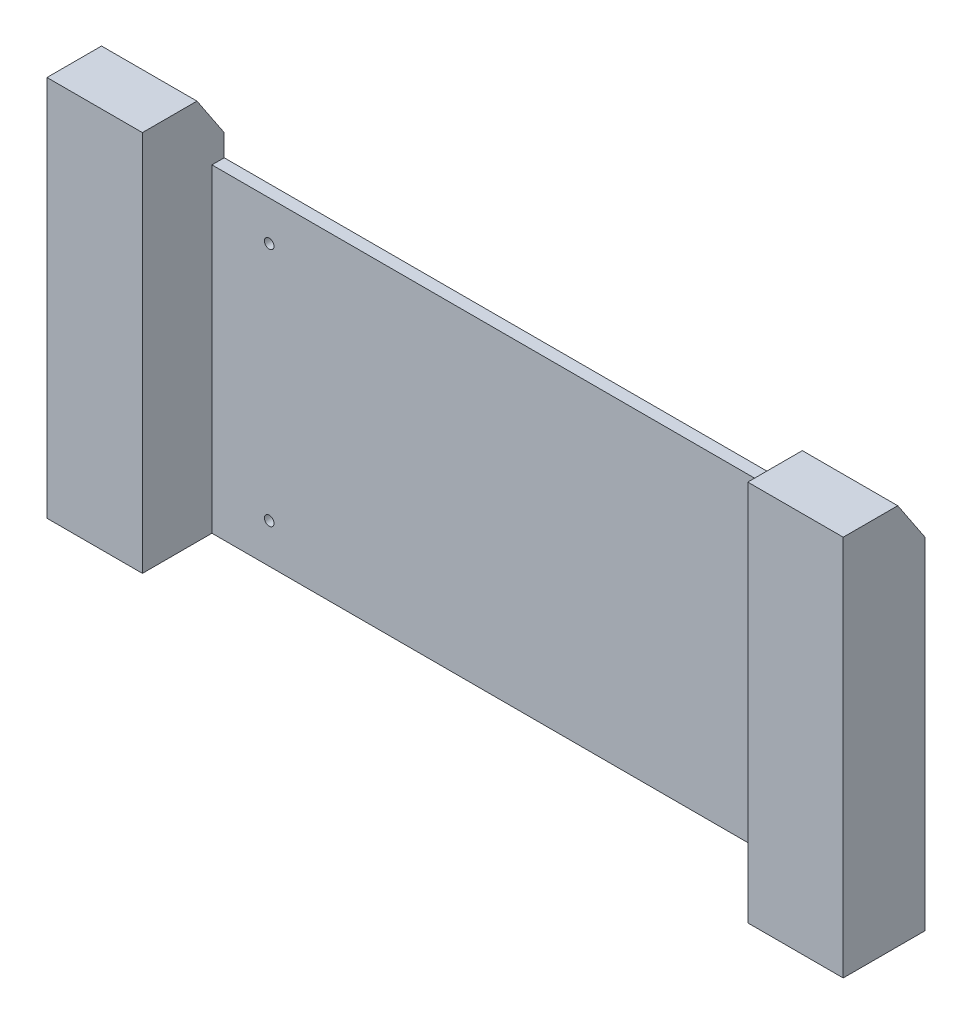
ISO-10303-21;
HEADER;
FILE_DESCRIPTION(('STEP AP214'),'2;1');
FILE_NAME('part.step','',(''),(''),'','','');
FILE_SCHEMA(('AUTOMOTIVE_DESIGN { 1 0 10303 214 1 1 1 1 }'));
ENDSEC;
DATA;
#1=APPLICATION_CONTEXT('core data for automotive mechanical design processes');
#2=APPLICATION_PROTOCOL_DEFINITION('international standard','automotive_design',2000,#1);
#3=PRODUCT_CONTEXT('',#1,'mechanical');
#4=PRODUCT('Part','Part','',(#3));
#5=PRODUCT_RELATED_PRODUCT_CATEGORY('part','',(#4));
#6=PRODUCT_DEFINITION_FORMATION('','',#4);
#7=PRODUCT_DEFINITION_CONTEXT('part definition',#1,'design');
#8=PRODUCT_DEFINITION('design','',#6,#7);
#9=PRODUCT_DEFINITION_SHAPE('','',#8);
#10=(LENGTH_UNIT() NAMED_UNIT(*) SI_UNIT(.MILLI.,.METRE.));
#11=(NAMED_UNIT(*) PLANE_ANGLE_UNIT() SI_UNIT($,.RADIAN.));
#12=(NAMED_UNIT(*) SI_UNIT($,.STERADIAN.) SOLID_ANGLE_UNIT());
#13=UNCERTAINTY_MEASURE_WITH_UNIT(LENGTH_MEASURE(1.E-05),#10,'distance_accuracy_value','');
#14=(GEOMETRIC_REPRESENTATION_CONTEXT(3) GLOBAL_UNCERTAINTY_ASSIGNED_CONTEXT((#13)) GLOBAL_UNIT_ASSIGNED_CONTEXT((#10,
#11,#12)) REPRESENTATION_CONTEXT('',''));
#15=CARTESIAN_POINT('',(0.,0.,0.));
#16=DIRECTION('',(0.,0.,1.));
#17=DIRECTION('',(1.,0.,0.));
#18=AXIS2_PLACEMENT_3D('',#15,#16,#17);
#19=CARTESIAN_POINT('',(0.,58.5,4.5));
#20=DIRECTION('',(0.,-1.,0.));
#21=DIRECTION('',(1.,0.,0.));
#22=AXIS2_PLACEMENT_3D('',#19,#20,#21);
#23=PLANE('',#22);
#24=DIRECTION('',(0.,0.,-1.));
#25=VECTOR('',#24,1.);
#26=CARTESIAN_POINT('',(-111.,58.5,4.5));
#27=LINE('',#26,#25);
#28=CARTESIAN_POINT('',(-111.,58.5,4.5));
#29=VERTEX_POINT('',#28);
#30=CARTESIAN_POINT('',(-111.,58.5,0.));
#31=VERTEX_POINT('',#30);
#32=EDGE_CURVE('E175',#29,#31,#27,.T.);
#33=ORIENTED_EDGE('',*,*,#32,.F.);
#34=DIRECTION('',(-1.,0.,0.));
#35=VECTOR('',#34,1.);
#36=CARTESIAN_POINT('',(0.,58.5,4.5));
#37=LINE('',#36,#35);
#38=CARTESIAN_POINT('',(111.,58.5,4.5));
#39=VERTEX_POINT('',#38);
#40=EDGE_CURVE('E254',#39,#29,#37,.T.);
#41=ORIENTED_EDGE('',*,*,#40,.F.);
#42=DIRECTION('',(0.,0.,-1.));
#43=VECTOR('',#42,1.);
#44=CARTESIAN_POINT('',(111.,58.5,4.5));
#45=LINE('',#44,#43);
#46=CARTESIAN_POINT('',(111.,58.5,0.));
#47=VERTEX_POINT('',#46);
#48=EDGE_CURVE('E213',#39,#47,#45,.T.);
#49=ORIENTED_EDGE('',*,*,#48,.T.);
#50=DIRECTION('',(-1.,0.,0.));
#51=VECTOR('',#50,1.);
#52=CARTESIAN_POINT('',(0.,58.5,0.));
#53=LINE('',#52,#51);
#54=EDGE_CURVE('E255',#47,#31,#53,.T.);
#55=ORIENTED_EDGE('',*,*,#54,.T.);
#56=EDGE_LOOP('',(#33,#41,#49,#55));
#57=FACE_BOUND('',#56,.T.);
#58=ADVANCED_FACE('F41',(#57),#23,.F.);
#59=CARTESIAN_POINT('',(0.,0.,4.5));
#60=DIRECTION('',(0.,0.,1.));
#61=DIRECTION('',(1.,0.,0.));
#62=AXIS2_PLACEMENT_3D('',#59,#60,#61);
#63=PLANE('',#62);
#64=CARTESIAN_POINT('',(89.9999999999999,44.,4.5));
#65=DIRECTION('',(0.,0.,1.));
#66=DIRECTION('',(1.,0.,0.));
#67=AXIS2_PLACEMENT_3D('',#64,#65,#66);
#68=CIRCLE('',#67,1.75);
#69=CARTESIAN_POINT('',(91.7499999999999,44.,4.5));
#70=VERTEX_POINT('',#69);
#71=EDGE_CURVE('E217',#70,#70,#68,.F.);
#72=ORIENTED_EDGE('',*,*,#71,.T.);
#73=EDGE_LOOP('',(#72));
#74=FACE_BOUND('',#73,.T.);
#75=CARTESIAN_POINT('',(89.9999999999999,-44.,4.5));
#76=DIRECTION('',(0.,0.,1.));
#77=DIRECTION('',(1.,0.,0.));
#78=AXIS2_PLACEMENT_3D('',#75,#76,#77);
#79=CIRCLE('',#78,1.75);
#80=CARTESIAN_POINT('',(91.7499999999999,-44.,4.5));
#81=VERTEX_POINT('',#80);
#82=EDGE_CURVE('E229',#81,#81,#79,.T.);
#83=ORIENTED_EDGE('',*,*,#82,.F.);
#84=EDGE_LOOP('',(#83));
#85=FACE_BOUND('',#84,.T.);
#86=CARTESIAN_POINT('',(-89.9999999999999,-44.,4.5));
#87=DIRECTION('',(0.,0.,1.));
#88=DIRECTION('',(1.,0.,0.));
#89=AXIS2_PLACEMENT_3D('',#86,#87,#88);
#90=CIRCLE('',#89,1.75);
#91=CARTESIAN_POINT('',(-88.2499999999999,-44.,4.5));
#92=VERTEX_POINT('',#91);
#93=EDGE_CURVE('E233',#92,#92,#90,.F.);
#94=ORIENTED_EDGE('',*,*,#93,.T.);
#95=EDGE_LOOP('',(#94));
#96=FACE_BOUND('',#95,.T.);
#97=CARTESIAN_POINT('',(-89.9999999999999,44.,4.5));
#98=DIRECTION('',(0.,0.,1.));
#99=DIRECTION('',(1.,0.,0.));
#100=AXIS2_PLACEMENT_3D('',#97,#98,#99);
#101=CIRCLE('',#100,1.75);
#102=CARTESIAN_POINT('',(-88.2499999999999,44.,4.5));
#103=VERTEX_POINT('',#102);
#104=EDGE_CURVE('E245',#103,#103,#101,.T.);
#105=ORIENTED_EDGE('',*,*,#104,.F.);
#106=EDGE_LOOP('',(#105));
#107=FACE_BOUND('',#106,.T.);
#108=ORIENTED_EDGE('',*,*,#40,.T.);
#109=DIRECTION('',(0.,-1.,0.));
#110=VECTOR('',#109,1.);
#111=CARTESIAN_POINT('',(-111.,0.,4.5));
#112=LINE('',#111,#110);
#113=CARTESIAN_POINT('',(-111.,-58.5,4.5));
#114=VERTEX_POINT('',#113);
#115=EDGE_CURVE('E169',#29,#114,#112,.T.);
#116=ORIENTED_EDGE('',*,*,#115,.T.);
#117=DIRECTION('',(-1.,0.,0.));
#118=VECTOR('',#117,1.);
#119=CARTESIAN_POINT('',(0.,-58.5,4.5));
#120=LINE('',#119,#118);
#121=CARTESIAN_POINT('',(111.,-58.5,4.5));
#122=VERTEX_POINT('',#121);
#123=EDGE_CURVE('E250',#122,#114,#120,.T.);
#124=ORIENTED_EDGE('',*,*,#123,.F.);
#125=DIRECTION('',(0.,-1.,0.));
#126=VECTOR('',#125,1.);
#127=CARTESIAN_POINT('',(111.,0.,4.5));
#128=LINE('',#127,#126);
#129=EDGE_CURVE('E203',#39,#122,#128,.T.);
#130=ORIENTED_EDGE('',*,*,#129,.F.);
#131=EDGE_LOOP('',(#108,#116,#124,#130));
#132=FACE_BOUND('',#131,.T.);
#133=ADVANCED_FACE('F328',(#74,#85,#96,#107,#132),#63,.T.);
#134=CARTESIAN_POINT('',(-146.,0.,4.5));
#135=DIRECTION('',(-1.,0.,0.));
#136=DIRECTION('',(0.,0.,1.));
#137=AXIS2_PLACEMENT_3D('',#134,#135,#136);
#138=PLANE('',#137);
#139=DIRECTION('',(0.,0.,-1.));
#140=VECTOR('',#139,1.);
#141=CARTESIAN_POINT('',(-146.,81.5,30.));
#142=LINE('',#141,#140);
#143=CARTESIAN_POINT('',(-146.,81.5,30.));
#144=VERTEX_POINT('',#143);
#145=CARTESIAN_POINT('',(-146.,81.5,10.0000000000001));
#146=VERTEX_POINT('',#145);
#147=EDGE_CURVE('E144',#144,#146,#142,.T.);
#148=ORIENTED_EDGE('',*,*,#147,.T.);
#149=DIRECTION('',(0.,0.832050294337844,0.554700196225228));
#150=VECTOR('',#149,1.);
#151=CARTESIAN_POINT('',(-146.,22.5384615384615,-29.3076923076922));
#152=LINE('',#151,#150);
#153=CARTESIAN_POINT('',(-146.,66.4999999999999,0.));
#154=VERTEX_POINT('',#153);
#155=EDGE_CURVE('E64',#146,#154,#152,.F.);
#156=ORIENTED_EDGE('',*,*,#155,.T.);
#157=DIRECTION('',(0.,1.,0.));
#158=VECTOR('',#157,1.);
#159=CARTESIAN_POINT('',(-146.,0.,0.));
#160=LINE('',#159,#158);
#161=CARTESIAN_POINT('',(-146.,-58.5,0.));
#162=VERTEX_POINT('',#161);
#163=EDGE_CURVE('E249',#162,#154,#160,.T.);
#164=ORIENTED_EDGE('',*,*,#163,.F.);
#165=DIRECTION('',(0.,0.,-1.));
#166=VECTOR('',#165,1.);
#167=CARTESIAN_POINT('',(-146.,-58.5,4.5));
#168=LINE('',#167,#166);
#169=CARTESIAN_POINT('',(-146.,-58.5,30.));
#170=VERTEX_POINT('',#169);
#171=EDGE_CURVE('E154',#170,#162,#168,.T.);
#172=ORIENTED_EDGE('',*,*,#171,.F.);
#173=DIRECTION('',(0.,-1.,0.));
#174=VECTOR('',#173,1.);
#175=CARTESIAN_POINT('',(-146.,-58.5,30.));
#176=LINE('',#175,#174);
#177=EDGE_CURVE('E135',#144,#170,#176,.T.);
#178=ORIENTED_EDGE('',*,*,#177,.F.);
#179=EDGE_LOOP('',(#148,#156,#164,#172,#178));
#180=FACE_BOUND('',#179,.T.);
#181=ADVANCED_FACE('F152',(#180),#138,.T.);
#182=CARTESIAN_POINT('',(0.,-58.5,4.5));
#183=DIRECTION('',(0.,-1.,0.));
#184=DIRECTION('',(1.,0.,0.));
#185=AXIS2_PLACEMENT_3D('',#182,#183,#184);
#186=PLANE('',#185);
#187=ORIENTED_EDGE('',*,*,#171,.T.);
#188=DIRECTION('',(-1.,0.,0.));
#189=VECTOR('',#188,1.);
#190=CARTESIAN_POINT('',(0.,-58.5,0.));
#191=LINE('',#190,#189);
#192=CARTESIAN_POINT('',(146.,-58.5,0.));
#193=VERTEX_POINT('',#192);
#194=EDGE_CURVE('E262',#193,#162,#191,.T.);
#195=ORIENTED_EDGE('',*,*,#194,.F.);
#196=DIRECTION('',(0.,0.,-1.));
#197=VECTOR('',#196,1.);
#198=CARTESIAN_POINT('',(146.,-58.5,4.5));
#199=LINE('',#198,#197);
#200=CARTESIAN_POINT('',(146.,-58.5,30.));
#201=VERTEX_POINT('',#200);
#202=EDGE_CURVE('E259',#201,#193,#199,.T.);
#203=ORIENTED_EDGE('',*,*,#202,.F.);
#204=DIRECTION('',(-1.,0.,0.));
#205=VECTOR('',#204,1.);
#206=CARTESIAN_POINT('',(146.,-58.5,30.));
#207=LINE('',#206,#205);
#208=CARTESIAN_POINT('',(111.,-58.5,30.));
#209=VERTEX_POINT('',#208);
#210=EDGE_CURVE('E183',#201,#209,#207,.T.);
#211=ORIENTED_EDGE('',*,*,#210,.T.);
#212=DIRECTION('',(0.,0.,-1.));
#213=VECTOR('',#212,1.);
#214=CARTESIAN_POINT('',(111.,-58.5,30.));
#215=LINE('',#214,#213);
#216=EDGE_CURVE('E195',#209,#122,#215,.T.);
#217=ORIENTED_EDGE('',*,*,#216,.T.);
#218=ORIENTED_EDGE('',*,*,#123,.T.);
#219=DIRECTION('',(0.,0.,-1.));
#220=VECTOR('',#219,1.);
#221=CARTESIAN_POINT('',(-111.,-58.5,30.));
#222=LINE('',#221,#220);
#223=CARTESIAN_POINT('',(-111.,-58.5,30.));
#224=VERTEX_POINT('',#223);
#225=EDGE_CURVE('E166',#224,#114,#222,.T.);
#226=ORIENTED_EDGE('',*,*,#225,.F.);
#227=DIRECTION('',(1.,0.,0.));
#228=VECTOR('',#227,1.);
#229=CARTESIAN_POINT('',(-146.,-58.5,30.));
#230=LINE('',#229,#228);
#231=EDGE_CURVE('E150',#170,#224,#230,.T.);
#232=ORIENTED_EDGE('',*,*,#231,.F.);
#233=EDGE_LOOP('',(#187,#195,#203,#211,#217,#218,#226,#232));
#234=FACE_BOUND('',#233,.T.);
#235=ADVANCED_FACE('F316',(#234),#186,.T.);
#236=CARTESIAN_POINT('',(146.,0.,4.5));
#237=DIRECTION('',(-1.,0.,0.));
#238=DIRECTION('',(0.,0.,1.));
#239=AXIS2_PLACEMENT_3D('',#236,#237,#238);
#240=PLANE('',#239);
#241=DIRECTION('',(0.,1.,0.));
#242=VECTOR('',#241,1.);
#243=CARTESIAN_POINT('',(146.,0.,0.));
#244=LINE('',#243,#242);
#245=CARTESIAN_POINT('',(146.,66.4999999999999,0.));
#246=VERTEX_POINT('',#245);
#247=EDGE_CURVE('E265',#193,#246,#244,.T.);
#248=ORIENTED_EDGE('',*,*,#247,.T.);
#249=DIRECTION('',(0.,0.832050294337844,0.554700196225228));
#250=VECTOR('',#249,1.);
#251=CARTESIAN_POINT('',(146.,66.4999999999999,0.));
#252=LINE('',#251,#250);
#253=CARTESIAN_POINT('',(146.,81.5,10.0000000000001));
#254=VERTEX_POINT('',#253);
#255=EDGE_CURVE('E280',#246,#254,#252,.T.);
#256=ORIENTED_EDGE('',*,*,#255,.T.);
#257=DIRECTION('',(0.,0.,-1.));
#258=VECTOR('',#257,1.);
#259=CARTESIAN_POINT('',(146.,81.5,30.));
#260=LINE('',#259,#258);
#261=CARTESIAN_POINT('',(146.,81.5,30.));
#262=VERTEX_POINT('',#261);
#263=EDGE_CURVE('E199',#262,#254,#260,.T.);
#264=ORIENTED_EDGE('',*,*,#263,.F.);
#265=DIRECTION('',(0.,-1.,0.));
#266=VECTOR('',#265,1.);
#267=CARTESIAN_POINT('',(146.,-58.5,30.));
#268=LINE('',#267,#266);
#269=EDGE_CURVE('E179',#262,#201,#268,.T.);
#270=ORIENTED_EDGE('',*,*,#269,.T.);
#271=ORIENTED_EDGE('',*,*,#202,.T.);
#272=EDGE_LOOP('',(#248,#256,#264,#270,#271));
#273=FACE_BOUND('',#272,.T.);
#274=ADVANCED_FACE('F305',(#273),#240,.F.);
#275=CARTESIAN_POINT('',(0.,0.,0.));
#276=DIRECTION('',(0.,0.,1.));
#277=DIRECTION('',(1.,0.,0.));
#278=AXIS2_PLACEMENT_3D('',#275,#276,#277);
#279=PLANE('',#278);
#280=ORIENTED_EDGE('',*,*,#163,.T.);
#281=DIRECTION('',(1.,0.,0.));
#282=VECTOR('',#281,1.);
#283=CARTESIAN_POINT('',(0.,66.4999999999999,0.));
#284=LINE('',#283,#282);
#285=CARTESIAN_POINT('',(-111.,66.4999999999999,0.));
#286=VERTEX_POINT('',#285);
#287=EDGE_CURVE('E50',#154,#286,#284,.T.);
#288=ORIENTED_EDGE('',*,*,#287,.T.);
#289=DIRECTION('',(0.,1.,0.));
#290=VECTOR('',#289,1.);
#291=CARTESIAN_POINT('',(-111.,-58.5,0.));
#292=LINE('',#291,#290);
#293=EDGE_CURVE('E157',#31,#286,#292,.T.);
#294=ORIENTED_EDGE('',*,*,#293,.F.);
#295=ORIENTED_EDGE('',*,*,#54,.F.);
#296=DIRECTION('',(0.,1.,0.));
#297=VECTOR('',#296,1.);
#298=CARTESIAN_POINT('',(111.,-58.5,0.));
#299=LINE('',#298,#297);
#300=CARTESIAN_POINT('',(111.,66.4999999999999,0.));
#301=VERTEX_POINT('',#300);
#302=EDGE_CURVE('E178',#47,#301,#299,.T.);
#303=ORIENTED_EDGE('',*,*,#302,.T.);
#304=DIRECTION('',(1.,0.,0.));
#305=VECTOR('',#304,1.);
#306=CARTESIAN_POINT('',(146.,66.4999999999999,0.));
#307=LINE('',#306,#305);
#308=EDGE_CURVE('E276',#301,#246,#307,.T.);
#309=ORIENTED_EDGE('',*,*,#308,.T.);
#310=ORIENTED_EDGE('',*,*,#247,.F.);
#311=ORIENTED_EDGE('',*,*,#194,.T.);
#312=EDGE_LOOP('',(#280,#288,#294,#295,#303,#309,#310,#311));
#313=FACE_BOUND('',#312,.T.);
#314=CARTESIAN_POINT('',(-89.9999999999999,44.,0.));
#315=DIRECTION('',(0.,0.,1.));
#316=DIRECTION('',(1.,0.,0.));
#317=AXIS2_PLACEMENT_3D('',#314,#315,#316);
#318=CIRCLE('',#317,1.75);
#319=CARTESIAN_POINT('',(-88.2499999999999,44.,0.));
#320=VERTEX_POINT('',#319);
#321=EDGE_CURVE('E238',#320,#320,#318,.T.);
#322=ORIENTED_EDGE('',*,*,#321,.T.);
#323=EDGE_LOOP('',(#322));
#324=FACE_BOUND('',#323,.T.);
#325=CARTESIAN_POINT('',(-89.9999999999999,-44.,0.));
#326=DIRECTION('',(0.,0.,-1.));
#327=DIRECTION('',(1.,0.,0.));
#328=AXIS2_PLACEMENT_3D('',#325,#326,#327);
#329=CIRCLE('',#328,1.75);
#330=CARTESIAN_POINT('',(-88.2499999999999,-44.,0.));
#331=VERTEX_POINT('',#330);
#332=EDGE_CURVE('E234',#331,#331,#329,.T.);
#333=ORIENTED_EDGE('',*,*,#332,.F.);
#334=EDGE_LOOP('',(#333));
#335=FACE_BOUND('',#334,.T.);
#336=CARTESIAN_POINT('',(89.9999999999999,-44.,0.));
#337=DIRECTION('',(0.,0.,1.));
#338=DIRECTION('',(-1.,0.,0.));
#339=AXIS2_PLACEMENT_3D('',#336,#337,#338);
#340=CIRCLE('',#339,1.75);
#341=CARTESIAN_POINT('',(88.2499999999999,-44.,0.));
#342=VERTEX_POINT('',#341);
#343=EDGE_CURVE('E222',#342,#342,#340,.T.);
#344=ORIENTED_EDGE('',*,*,#343,.T.);
#345=EDGE_LOOP('',(#344));
#346=FACE_BOUND('',#345,.T.);
#347=CARTESIAN_POINT('',(89.9999999999999,44.,0.));
#348=DIRECTION('',(0.,0.,-1.));
#349=DIRECTION('',(-1.,0.,0.));
#350=AXIS2_PLACEMENT_3D('',#347,#348,#349);
#351=CIRCLE('',#350,1.75);
#352=CARTESIAN_POINT('',(88.2499999999999,44.,0.));
#353=VERTEX_POINT('',#352);
#354=EDGE_CURVE('E218',#353,#353,#351,.T.);
#355=ORIENTED_EDGE('',*,*,#354,.F.);
#356=EDGE_LOOP('',(#355));
#357=FACE_BOUND('',#356,.T.);
#358=ADVANCED_FACE('F300',(#313,#324,#335,#346,#357),#279,.F.);
#359=CARTESIAN_POINT('',(-89.9999999999999,44.,4.501));
#360=DIRECTION('',(0.,0.,-1.));
#361=DIRECTION('',(-1.,0.,0.));
#362=AXIS2_PLACEMENT_3D('',#359,#360,#361);
#363=CYLINDRICAL_SURFACE('',#362,1.75);
#364=ORIENTED_EDGE('',*,*,#104,.T.);
#365=EDGE_LOOP('',(#364));
#366=FACE_BOUND('',#365,.T.);
#367=ORIENTED_EDGE('',*,*,#321,.F.);
#368=EDGE_LOOP('',(#367));
#369=FACE_BOUND('',#368,.T.);
#370=ADVANCED_FACE('F341',(#366,#369),#363,.F.);
#371=CARTESIAN_POINT('',(-89.9999999999999,-44.,4.501));
#372=DIRECTION('',(0.,0.,-1.));
#373=DIRECTION('',(-1.,0.,0.));
#374=AXIS2_PLACEMENT_3D('',#371,#372,#373);
#375=CYLINDRICAL_SURFACE('',#374,1.75);
#376=ORIENTED_EDGE('',*,*,#93,.F.);
#377=EDGE_LOOP('',(#376));
#378=FACE_BOUND('',#377,.T.);
#379=ORIENTED_EDGE('',*,*,#332,.T.);
#380=EDGE_LOOP('',(#379));
#381=FACE_BOUND('',#380,.T.);
#382=ADVANCED_FACE('F369',(#378,#381),#375,.F.);
#383=CARTESIAN_POINT('',(89.9999999999999,-44.,4.501));
#384=DIRECTION('',(0.,0.,-1.));
#385=DIRECTION('',(-1.,0.,0.));
#386=AXIS2_PLACEMENT_3D('',#383,#384,#385);
#387=CYLINDRICAL_SURFACE('',#386,1.75);
#388=ORIENTED_EDGE('',*,*,#82,.T.);
#389=EDGE_LOOP('',(#388));
#390=FACE_BOUND('',#389,.T.);
#391=ORIENTED_EDGE('',*,*,#343,.F.);
#392=EDGE_LOOP('',(#391));
#393=FACE_BOUND('',#392,.T.);
#394=ADVANCED_FACE('F366',(#390,#393),#387,.F.);
#395=CARTESIAN_POINT('',(89.9999999999999,44.,4.501));
#396=DIRECTION('',(0.,0.,-1.));
#397=DIRECTION('',(-1.,0.,0.));
#398=AXIS2_PLACEMENT_3D('',#395,#396,#397);
#399=CYLINDRICAL_SURFACE('',#398,1.75);
#400=ORIENTED_EDGE('',*,*,#71,.F.);
#401=EDGE_LOOP('',(#400));
#402=FACE_BOUND('',#401,.T.);
#403=ORIENTED_EDGE('',*,*,#354,.T.);
#404=EDGE_LOOP('',(#403));
#405=FACE_BOUND('',#404,.T.);
#406=ADVANCED_FACE('F363',(#402,#405),#399,.F.);
#407=CARTESIAN_POINT('',(111.,-58.5,30.));
#408=DIRECTION('',(-1.,0.,0.));
#409=DIRECTION('',(0.,0.,1.));
#410=AXIS2_PLACEMENT_3D('',#407,#408,#409);
#411=PLANE('',#410);
#412=DIRECTION('',(0.,0.,-1.));
#413=VECTOR('',#412,1.);
#414=CARTESIAN_POINT('',(111.,81.5,30.));
#415=LINE('',#414,#413);
#416=CARTESIAN_POINT('',(111.,81.5,30.));
#417=VERTEX_POINT('',#416);
#418=CARTESIAN_POINT('',(111.,81.5,10.0000000000001));
#419=VERTEX_POINT('',#418);
#420=EDGE_CURVE('E204',#417,#419,#415,.T.);
#421=ORIENTED_EDGE('',*,*,#420,.T.);
#422=DIRECTION('',(0.,-0.832050294337844,-0.554700196225228));
#423=VECTOR('',#422,1.);
#424=CARTESIAN_POINT('',(111.,-6.19230769230783,-48.4615384615384));
#425=LINE('',#424,#423);
#426=EDGE_CURVE('E286',#419,#301,#425,.T.);
#427=ORIENTED_EDGE('',*,*,#426,.T.);
#428=ORIENTED_EDGE('',*,*,#302,.F.);
#429=ORIENTED_EDGE('',*,*,#48,.F.);
#430=ORIENTED_EDGE('',*,*,#129,.T.);
#431=ORIENTED_EDGE('',*,*,#216,.F.);
#432=DIRECTION('',(0.,1.,0.));
#433=VECTOR('',#432,1.);
#434=CARTESIAN_POINT('',(111.,-58.5,30.));
#435=LINE('',#434,#433);
#436=EDGE_CURVE('E187',#209,#417,#435,.T.);
#437=ORIENTED_EDGE('',*,*,#436,.T.);
#438=EDGE_LOOP('',(#421,#427,#428,#429,#430,#431,#437));
#439=FACE_BOUND('',#438,.T.);
#440=ADVANCED_FACE('F295',(#439),#411,.T.);
#441=CARTESIAN_POINT('',(146.,81.5,30.));
#442=DIRECTION('',(0.,1.,0.));
#443=DIRECTION('',(0.,0.,1.));
#444=AXIS2_PLACEMENT_3D('',#441,#442,#443);
#445=PLANE('',#444);
#446=ORIENTED_EDGE('',*,*,#263,.T.);
#447=DIRECTION('',(-1.,0.,0.));
#448=VECTOR('',#447,1.);
#449=CARTESIAN_POINT('',(111.,81.5,10.0000000000001));
#450=LINE('',#449,#448);
#451=EDGE_CURVE('E283',#254,#419,#450,.T.);
#452=ORIENTED_EDGE('',*,*,#451,.T.);
#453=ORIENTED_EDGE('',*,*,#420,.F.);
#454=DIRECTION('',(1.,0.,0.));
#455=VECTOR('',#454,1.);
#456=CARTESIAN_POINT('',(146.,81.5,30.));
#457=LINE('',#456,#455);
#458=EDGE_CURVE('E191',#417,#262,#457,.T.);
#459=ORIENTED_EDGE('',*,*,#458,.T.);
#460=EDGE_LOOP('',(#446,#452,#453,#459));
#461=FACE_BOUND('',#460,.T.);
#462=ADVANCED_FACE('F308',(#461),#445,.T.);
#463=CARTESIAN_POINT('',(0.,0.,30.));
#464=DIRECTION('',(0.,0.,1.));
#465=DIRECTION('',(1.,0.,0.));
#466=AXIS2_PLACEMENT_3D('',#463,#464,#465);
#467=PLANE('',#466);
#468=ORIENTED_EDGE('',*,*,#269,.F.);
#469=ORIENTED_EDGE('',*,*,#458,.F.);
#470=ORIENTED_EDGE('',*,*,#436,.F.);
#471=ORIENTED_EDGE('',*,*,#210,.F.);
#472=EDGE_LOOP('',(#468,#469,#470,#471));
#473=FACE_BOUND('',#472,.T.);
#474=ADVANCED_FACE('F312',(#473),#467,.T.);
#475=CARTESIAN_POINT('',(0.,66.4999999999999,0.));
#476=DIRECTION('',(0.,0.554700196225228,-0.832050294337844));
#477=DIRECTION('',(-1.,0.,0.));
#478=AXIS2_PLACEMENT_3D('',#475,#476,#477);
#479=PLANE('',#478);
#480=ORIENTED_EDGE('',*,*,#426,.F.);
#481=ORIENTED_EDGE('',*,*,#451,.F.);
#482=ORIENTED_EDGE('',*,*,#255,.F.);
#483=ORIENTED_EDGE('',*,*,#308,.F.);
#484=EDGE_LOOP('',(#480,#481,#482,#483));
#485=FACE_BOUND('',#484,.T.);
#486=ADVANCED_FACE('F303',(#485),#479,.T.);
#487=CARTESIAN_POINT('',(-111.,-58.5,30.));
#488=DIRECTION('',(-1.,0.,0.));
#489=DIRECTION('',(0.,0.,1.));
#490=AXIS2_PLACEMENT_3D('',#487,#488,#489);
#491=PLANE('',#490);
#492=ORIENTED_EDGE('',*,*,#293,.T.);
#493=DIRECTION('',(0.,-0.832050294337844,-0.554700196225228));
#494=VECTOR('',#493,1.);
#495=CARTESIAN_POINT('',(-111.,81.5,10.0000000000001));
#496=LINE('',#495,#494);
#497=CARTESIAN_POINT('',(-111.,81.5,10.0000000000001));
#498=VERTEX_POINT('',#497);
#499=EDGE_CURVE('E11',#286,#498,#496,.F.);
#500=ORIENTED_EDGE('',*,*,#499,.T.);
#501=DIRECTION('',(0.,0.,-1.));
#502=VECTOR('',#501,1.);
#503=CARTESIAN_POINT('',(-111.,81.5,30.));
#504=LINE('',#503,#502);
#505=CARTESIAN_POINT('',(-111.,81.5,30.));
#506=VERTEX_POINT('',#505);
#507=EDGE_CURVE('E149',#506,#498,#504,.T.);
#508=ORIENTED_EDGE('',*,*,#507,.F.);
#509=DIRECTION('',(0.,1.,0.));
#510=VECTOR('',#509,1.);
#511=CARTESIAN_POINT('',(-111.,-58.5,30.));
#512=LINE('',#511,#510);
#513=EDGE_CURVE('E137',#224,#506,#512,.T.);
#514=ORIENTED_EDGE('',*,*,#513,.F.);
#515=ORIENTED_EDGE('',*,*,#225,.T.);
#516=ORIENTED_EDGE('',*,*,#115,.F.);
#517=ORIENTED_EDGE('',*,*,#32,.T.);
#518=EDGE_LOOP('',(#492,#500,#508,#514,#515,#516,#517));
#519=FACE_BOUND('',#518,.T.);
#520=ADVANCED_FACE('F321',(#519),#491,.F.);
#521=CARTESIAN_POINT('',(-146.,81.5,30.));
#522=DIRECTION('',(0.,-1.,0.));
#523=DIRECTION('',(0.,0.,-1.));
#524=AXIS2_PLACEMENT_3D('',#521,#522,#523);
#525=PLANE('',#524);
#526=ORIENTED_EDGE('',*,*,#507,.T.);
#527=DIRECTION('',(-1.,0.,0.));
#528=VECTOR('',#527,1.);
#529=CARTESIAN_POINT('',(-146.,81.5,10.0000000000001));
#530=LINE('',#529,#528);
#531=EDGE_CURVE('E147',#498,#146,#530,.T.);
#532=ORIENTED_EDGE('',*,*,#531,.T.);
#533=ORIENTED_EDGE('',*,*,#147,.F.);
#534=DIRECTION('',(-1.,0.,0.));
#535=VECTOR('',#534,1.);
#536=CARTESIAN_POINT('',(-146.,81.5,30.));
#537=LINE('',#536,#535);
#538=EDGE_CURVE('E131',#506,#144,#537,.T.);
#539=ORIENTED_EDGE('',*,*,#538,.F.);
#540=EDGE_LOOP('',(#526,#532,#533,#539));
#541=FACE_BOUND('',#540,.T.);
#542=ADVANCED_FACE('F145',(#541),#525,.F.);
#543=CARTESIAN_POINT('',(0.,0.,30.));
#544=DIRECTION('',(0.,0.,1.));
#545=DIRECTION('',(-1.,0.,0.));
#546=AXIS2_PLACEMENT_3D('',#543,#544,#545);
#547=PLANE('',#546);
#548=ORIENTED_EDGE('',*,*,#177,.T.);
#549=ORIENTED_EDGE('',*,*,#231,.T.);
#550=ORIENTED_EDGE('',*,*,#513,.T.);
#551=ORIENTED_EDGE('',*,*,#538,.T.);
#552=EDGE_LOOP('',(#548,#549,#550,#551));
#553=FACE_BOUND('',#552,.T.);
#554=ADVANCED_FACE('F133',(#553),#547,.T.);
#555=CARTESIAN_POINT('',(-146.,81.5,10.0000000000001));
#556=DIRECTION('',(0.,-0.554700196225228,0.832050294337844));
#557=DIRECTION('',(-1.,0.,0.));
#558=AXIS2_PLACEMENT_3D('',#555,#556,#557);
#559=PLANE('',#558);
#560=ORIENTED_EDGE('',*,*,#499,.F.);
#561=ORIENTED_EDGE('',*,*,#287,.F.);
#562=ORIENTED_EDGE('',*,*,#155,.F.);
#563=ORIENTED_EDGE('',*,*,#531,.F.);
#564=EDGE_LOOP('',(#560,#561,#562,#563));
#565=FACE_BOUND('',#564,.T.);
#566=ADVANCED_FACE('F43',(#565),#559,.F.);
#567=CLOSED_SHELL('',(#58,#133,#181,#235,#274,#358,#370,#382,#394,#406,#440,#462,#474,#486,#520,
#542,#554,#566));
#568=MANIFOLD_SOLID_BREP('B2',#567);
#569=ADVANCED_BREP_SHAPE_REPRESENTATION('',(#18,#568),#14);
#570=SHAPE_DEFINITION_REPRESENTATION(#9,#569);
ENDSEC;
END-ISO-10303-21;
